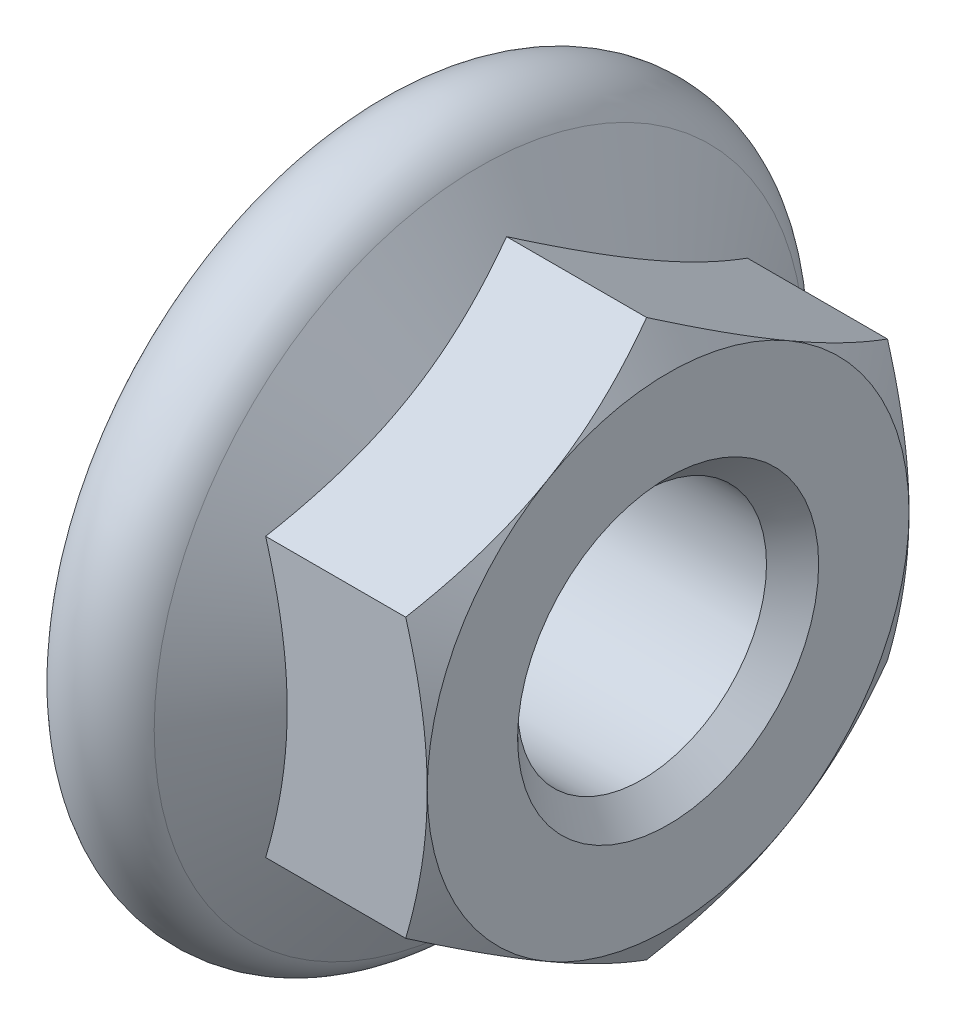
ISO-10303-21;
HEADER;
FILE_DESCRIPTION(('STEP AP214'),'2;1');
FILE_NAME('part.step','',(''),(''),'','','');
FILE_SCHEMA(('AUTOMOTIVE_DESIGN { 1 0 10303 214 1 1 1 1 }'));
ENDSEC;
DATA;
#1=APPLICATION_CONTEXT('core data for automotive mechanical design processes');
#2=APPLICATION_PROTOCOL_DEFINITION('international standard','automotive_design',2000,#1);
#3=PRODUCT_CONTEXT('',#1,'mechanical');
#4=PRODUCT('Part','Part','',(#3));
#5=PRODUCT_RELATED_PRODUCT_CATEGORY('part','',(#4));
#6=PRODUCT_DEFINITION_FORMATION('','',#4);
#7=PRODUCT_DEFINITION_CONTEXT('part definition',#1,'design');
#8=PRODUCT_DEFINITION('design','',#6,#7);
#9=PRODUCT_DEFINITION_SHAPE('','',#8);
#10=(LENGTH_UNIT() NAMED_UNIT(*) SI_UNIT(.MILLI.,.METRE.));
#11=(NAMED_UNIT(*) PLANE_ANGLE_UNIT() SI_UNIT($,.RADIAN.));
#12=(NAMED_UNIT(*) SI_UNIT($,.STERADIAN.) SOLID_ANGLE_UNIT());
#13=UNCERTAINTY_MEASURE_WITH_UNIT(LENGTH_MEASURE(1.E-05),#10,'distance_accuracy_value','');
#14=(GEOMETRIC_REPRESENTATION_CONTEXT(3) GLOBAL_UNCERTAINTY_ASSIGNED_CONTEXT((#13)) GLOBAL_UNIT_ASSIGNED_CONTEXT((#10,
#11,#12)) REPRESENTATION_CONTEXT('',''));
#15=CARTESIAN_POINT('',(0.,0.,0.));
#16=DIRECTION('',(0.,0.,1.));
#17=DIRECTION('',(1.,0.,0.));
#18=AXIS2_PLACEMENT_3D('',#15,#16,#17);
#19=CARTESIAN_POINT('',(2.67431578064992,0.,0.));
#20=DIRECTION('',(-1.,0.,0.));
#21=DIRECTION('',(0.,0.,1.));
#22=AXIS2_PLACEMENT_3D('',#19,#20,#21);
#23=CONICAL_SURFACE('',#22,4.,1.0471975511966);
#24=CARTESIAN_POINT('',(1.86602540378444,0.,0.));
#25=DIRECTION('',(-1.,0.,0.));
#26=DIRECTION('',(0.,0.,1.));
#27=AXIS2_PLACEMENT_3D('',#24,#25,#26);
#28=CIRCLE('',#27,5.4);
#29=CARTESIAN_POINT('',(1.86602540378444,0.,5.4));
#30=VERTEX_POINT('',#29);
#31=EDGE_CURVE('E242',#30,#30,#28,.T.);
#32=ORIENTED_EDGE('',*,*,#31,.F.);
#33=EDGE_LOOP('',(#32));
#34=FACE_BOUND('',#33,.T.);
#35=CARTESIAN_POINT('',(2.31705019074175,-2.3094010767585,-4.));
#36=CARTESIAN_POINT('',(2.37178264259741,-2.11982214780258,-4.));
#37=CARTESIAN_POINT('',(2.42189174829399,-1.92874348169977,-4.));
#38=CARTESIAN_POINT('',(2.51045337647502,-1.54348220920257,-4.));
#39=CARTESIAN_POINT('',(2.54887981806681,-1.34929366206929,-4.));
#40=CARTESIAN_POINT('',(2.61067418712992,-0.963095536695321,-4.));
#41=CARTESIAN_POINT('',(2.63437157633848,-0.771140332076515,-4.));
#42=CARTESIAN_POINT('',(2.666183916006,-0.386122464294638,-4.));
#43=CARTESIAN_POINT('',(2.67431578064992,-0.193061232147319,-4.));
#44=CARTESIAN_POINT('',(2.67431578064992,0.193061232147319,-4.));
#45=CARTESIAN_POINT('',(2.666183916006,0.386122464294637,-4.));
#46=CARTESIAN_POINT('',(2.63437157633848,0.771140332076515,-4.));
#47=CARTESIAN_POINT('',(2.61067418712992,0.963095536695321,-4.));
#48=CARTESIAN_POINT('',(2.54887981806681,1.34929366206929,-4.));
#49=CARTESIAN_POINT('',(2.51045337647502,1.54348220920257,-4.));
#50=CARTESIAN_POINT('',(2.42189174829399,1.92874348169977,-4.));
#51=CARTESIAN_POINT('',(2.37178264259741,2.11982214780258,-4.));
#52=CARTESIAN_POINT('',(2.31705019074175,2.3094010767585,-4.));
#53=B_SPLINE_CURVE_WITH_KNOTS('',3,(#35,#36,#37,#38,#39,#40,#41,#42,#43,#44,#45,#46,#47,#48,#49,
#50,#51,#52),.UNSPECIFIED.,.F.,.F.,(4,2,2,2,2,2,2,2,4),(0.,0.592146791772327,1.18560597204259,
1.76526171820572,2.34428722651546,2.9233127348252,3.50296848098833,4.09642766125859,
4.68857445303092),.UNSPECIFIED.);
#54=CARTESIAN_POINT('',(2.31705019074175,-2.3094010767585,-4.));
#55=VERTEX_POINT('',#54);
#56=CARTESIAN_POINT('',(2.31705019074175,2.3094010767585,-4.));
#57=VERTEX_POINT('',#56);
#58=EDGE_CURVE('E85',#55,#57,#53,.T.);
#59=ORIENTED_EDGE('',*,*,#58,.F.);
#60=CARTESIAN_POINT('',(2.31705019074175,-4.61880215351701,0.));
#61=CARTESIAN_POINT('',(2.37178264259741,-4.52401268903904,-0.16418016849807));
#62=CARTESIAN_POINT('',(2.42189174829399,-4.42847335598764,-0.329659147464344));
#63=CARTESIAN_POINT('',(2.51045337647503,-4.23584271973904,-0.663305196541237));
#64=CARTESIAN_POINT('',(2.54887981806681,-4.1387484461724,-0.831477411482652));
#65=CARTESIAN_POINT('',(2.61067418712992,-3.94564938348541,-1.16593479895044));
#66=CARTESIAN_POINT('',(2.63437157633848,-3.84967178117601,-1.33217288253896));
#67=CARTESIAN_POINT('',(2.66618391600601,-3.65716284728507,-1.66560813694899));
#68=CARTESIAN_POINT('',(2.67431578064992,-3.56063223121141,-1.83280406847449));
#69=CARTESIAN_POINT('',(2.67431578064992,-3.36757099906409,-2.1671959315255));
#70=CARTESIAN_POINT('',(2.66618391600601,-3.27104038299044,-2.334391863051));
#71=CARTESIAN_POINT('',(2.63437157633848,-3.0785314490995,-2.66782711746102));
#72=CARTESIAN_POINT('',(2.61067418712992,-2.98255384679009,-2.83406520104955));
#73=CARTESIAN_POINT('',(2.54887981806681,-2.78945478410311,-3.16852258851734));
#74=CARTESIAN_POINT('',(2.51045337647503,-2.69236051053647,-3.33669480345875));
#75=CARTESIAN_POINT('',(2.42189174829399,-2.49972987428787,-3.67034085253565));
#76=CARTESIAN_POINT('',(2.37178264259741,-2.40419054123646,-3.83581983150192));
#77=CARTESIAN_POINT('',(2.31705019074176,-2.3094010767585,-4.));
#78=B_SPLINE_CURVE_WITH_KNOTS('',3,(#60,#61,#62,#63,#64,#65,#66,#67,#68,#69,#70,#71,#72,#73,#74,
#75,#76,#77),.UNSPECIFIED.,.F.,.F.,(4,2,2,2,2,2,2,2,4),(0.,0.592146791772328,1.1856059720426,
1.76526171820573,2.34428722651546,2.9233127348252,3.50296848098833,4.0964276612586,
4.68857445303093),.UNSPECIFIED.);
#79=CARTESIAN_POINT('',(2.31705019074175,-4.61880215351701,0.));
#80=VERTEX_POINT('',#79);
#81=EDGE_CURVE('E88',#80,#55,#78,.T.);
#82=ORIENTED_EDGE('',*,*,#81,.F.);
#83=CARTESIAN_POINT('',(2.31705019074175,-2.3094010767585,4.00000000000001));
#84=CARTESIAN_POINT('',(2.37178264259741,-2.40419054123646,3.83581983150193));
#85=CARTESIAN_POINT('',(2.42189174829399,-2.49972987428787,3.67034085253566));
#86=CARTESIAN_POINT('',(2.51045337647502,-2.69236051053647,3.33669480345876));
#87=CARTESIAN_POINT('',(2.5488798180668,-2.78945478410311,3.16852258851735));
#88=CARTESIAN_POINT('',(2.61067418712992,-2.98255384679009,2.83406520104957));
#89=CARTESIAN_POINT('',(2.63437157633847,-3.0785314490995,2.66782711746104));
#90=CARTESIAN_POINT('',(2.666183916006,-3.27104038299043,2.33439186305102));
#91=CARTESIAN_POINT('',(2.67431578064992,-3.36757099906409,2.16719593152552));
#92=CARTESIAN_POINT('',(2.67431578064992,-3.56063223121141,1.83280406847451));
#93=CARTESIAN_POINT('',(2.666183916006,-3.65716284728507,1.66560813694901));
#94=CARTESIAN_POINT('',(2.63437157633847,-3.84967178117601,1.33217288253898));
#95=CARTESIAN_POINT('',(2.61067418712992,-3.94564938348542,1.16593479895045));
#96=CARTESIAN_POINT('',(2.54887981806681,-4.1387484461724,0.831477411482671));
#97=CARTESIAN_POINT('',(2.51045337647502,-4.23584271973905,0.663305196541255));
#98=CARTESIAN_POINT('',(2.42189174829399,-4.42847335598765,0.329659147464362));
#99=CARTESIAN_POINT('',(2.37178264259741,-4.52401268903905,0.164180168498087));
#100=CARTESIAN_POINT('',(2.31705019074175,-4.61880215351701,0.));
#101=B_SPLINE_CURVE_WITH_KNOTS('',3,(#83,#84,#85,#86,#87,#88,#89,#90,#91,#92,#93,#94,#95,#96,
#97,#98,#99,#100),.UNSPECIFIED.,.F.,.F.,(4,2,2,2,2,2,2,2,4),(0.,0.592146791772328,
1.18560597204259,1.76526171820572,2.34428722651546,2.9233127348252,3.50296848098833,
4.0964276612586,4.68857445303093),.UNSPECIFIED.);
#102=CARTESIAN_POINT('',(2.31705019074175,-2.3094010767585,4.00000000000001));
#103=VERTEX_POINT('',#102);
#104=EDGE_CURVE('E90',#103,#80,#101,.T.);
#105=ORIENTED_EDGE('',*,*,#104,.F.);
#106=CARTESIAN_POINT('',(2.31705019074175,2.30940107675851,4.));
#107=CARTESIAN_POINT('',(2.37178264259741,2.11982214780258,4.));
#108=CARTESIAN_POINT('',(2.42189174829399,1.92874348169978,4.));
#109=CARTESIAN_POINT('',(2.51045337647502,1.54348220920258,4.));
#110=CARTESIAN_POINT('',(2.54887981806681,1.34929366206929,4.));
#111=CARTESIAN_POINT('',(2.61067418712992,0.963095536695326,4.));
#112=CARTESIAN_POINT('',(2.63437157633847,0.77114033207652,4.));
#113=CARTESIAN_POINT('',(2.666183916006,0.386122464294641,4.));
#114=CARTESIAN_POINT('',(2.67431578064992,0.193061232147322,4.));
#115=CARTESIAN_POINT('',(2.67431578064992,-0.193061232147316,4.00000000000001));
#116=CARTESIAN_POINT('',(2.666183916006,-0.386122464294634,4.00000000000001));
#117=CARTESIAN_POINT('',(2.63437157633847,-0.771140332076512,4.00000000000001));
#118=CARTESIAN_POINT('',(2.61067418712992,-0.963095536695318,4.00000000000001));
#119=CARTESIAN_POINT('',(2.54887981806681,-1.34929366206929,4.00000000000001));
#120=CARTESIAN_POINT('',(2.51045337647502,-1.54348220920257,4.00000000000001));
#121=CARTESIAN_POINT('',(2.42189174829399,-1.92874348169977,4.00000000000001));
#122=CARTESIAN_POINT('',(2.37178264259741,-2.11982214780257,4.00000000000001));
#123=CARTESIAN_POINT('',(2.31705019074175,-2.3094010767585,4.00000000000001));
#124=B_SPLINE_CURVE_WITH_KNOTS('',3,(#106,#107,#108,#109,#110,#111,#112,#113,#114,#115,#116,
#117,#118,#119,#120,#121,#122,#123),.UNSPECIFIED.,.F.,.F.,(4,2,2,2,2,2,2,2,4),(0.,
0.592146791772328,1.1856059720426,1.76526171820573,2.34428722651547,2.9233127348252,
3.50296848098833,4.0964276612586,4.68857445303093),.UNSPECIFIED.);
#125=CARTESIAN_POINT('',(2.31705019074175,2.30940107675851,4.));
#126=VERTEX_POINT('',#125);
#127=EDGE_CURVE('E111',#126,#103,#124,.T.);
#128=ORIENTED_EDGE('',*,*,#127,.F.);
#129=CARTESIAN_POINT('',(2.31705019074175,4.61880215351701,0.));
#130=CARTESIAN_POINT('',(2.37178264259741,4.52401268903905,0.164180168498079));
#131=CARTESIAN_POINT('',(2.42189174829399,4.42847335598764,0.329659147464353));
#132=CARTESIAN_POINT('',(2.51045337647502,4.23584271973905,0.663305196541245));
#133=CARTESIAN_POINT('',(2.54887981806681,4.1387484461724,0.831477411482661));
#134=CARTESIAN_POINT('',(2.61067418712992,3.94564938348542,1.16593479895044));
#135=CARTESIAN_POINT('',(2.63437157633847,3.84967178117602,1.33217288253897));
#136=CARTESIAN_POINT('',(2.666183916006,3.65716284728508,1.66560813694899));
#137=CARTESIAN_POINT('',(2.67431578064992,3.56063223121142,1.8328040684745));
#138=CARTESIAN_POINT('',(2.67431578064992,3.3675709990641,2.1671959315255));
#139=CARTESIAN_POINT('',(2.666183916006,3.27104038299044,2.334391863051));
#140=CARTESIAN_POINT('',(2.63437157633847,3.0785314490995,2.66782711746103));
#141=CARTESIAN_POINT('',(2.61067418712992,2.9825538467901,2.83406520104955));
#142=CARTESIAN_POINT('',(2.54887981806681,2.78945478410312,3.16852258851734));
#143=CARTESIAN_POINT('',(2.51045337647502,2.69236051053648,3.33669480345875));
#144=CARTESIAN_POINT('',(2.42189174829399,2.49972987428788,3.67034085253565));
#145=CARTESIAN_POINT('',(2.37178264259741,2.40419054123647,3.83581983150192));
#146=CARTESIAN_POINT('',(2.31705019074175,2.30940107675851,4.));
#147=B_SPLINE_CURVE_WITH_KNOTS('',3,(#129,#130,#131,#132,#133,#134,#135,#136,#137,#138,#139,
#140,#141,#142,#143,#144,#145,#146),.UNSPECIFIED.,.F.,.F.,(4,2,2,2,2,2,2,2,4),(0.,
0.592146791772327,1.18560597204259,1.76526171820572,2.34428722651546,2.9233127348252,
3.50296848098832,4.09642766125859,4.68857445303092),.UNSPECIFIED.);
#148=CARTESIAN_POINT('',(2.31705019074175,4.61880215351701,0.));
#149=VERTEX_POINT('',#148);
#150=EDGE_CURVE('E115',#149,#126,#147,.T.);
#151=ORIENTED_EDGE('',*,*,#150,.F.);
#152=CARTESIAN_POINT('',(2.31705019074176,2.3094010767585,-4.));
#153=CARTESIAN_POINT('',(2.37178264259741,2.40419054123646,-3.83581983150192));
#154=CARTESIAN_POINT('',(2.42189174829399,2.49972987428787,-3.67034085253565));
#155=CARTESIAN_POINT('',(2.51045337647503,2.69236051053647,-3.33669480345876));
#156=CARTESIAN_POINT('',(2.54887981806681,2.78945478410311,-3.16852258851734));
#157=CARTESIAN_POINT('',(2.61067418712992,2.98255384679009,-2.83406520104956));
#158=CARTESIAN_POINT('',(2.63437157633848,3.0785314490995,-2.66782711746103));
#159=CARTESIAN_POINT('',(2.666183916006,3.27104038299043,-2.33439186305101));
#160=CARTESIAN_POINT('',(2.67431578064992,3.36757099906409,-2.1671959315255));
#161=CARTESIAN_POINT('',(2.67431578064992,3.56063223121141,-1.8328040684745));
#162=CARTESIAN_POINT('',(2.666183916006,3.65716284728507,-1.665608136949));
#163=CARTESIAN_POINT('',(2.63437157633848,3.84967178117601,-1.33217288253897));
#164=CARTESIAN_POINT('',(2.61067418712992,3.94564938348542,-1.16593479895044));
#165=CARTESIAN_POINT('',(2.54887981806681,4.1387484461724,-0.831477411482661));
#166=CARTESIAN_POINT('',(2.51045337647502,4.23584271973904,-0.663305196541245));
#167=CARTESIAN_POINT('',(2.42189174829399,4.42847335598764,-0.329659147464352));
#168=CARTESIAN_POINT('',(2.37178264259741,4.52401268903905,-0.164180168498078));
#169=CARTESIAN_POINT('',(2.31705019074175,4.61880215351701,0.));
#170=B_SPLINE_CURVE_WITH_KNOTS('',3,(#152,#153,#154,#155,#156,#157,#158,#159,#160,#161,#162,
#163,#164,#165,#166,#167,#168,#169),.UNSPECIFIED.,.F.,.F.,(4,2,2,2,2,2,2,2,4),(0.,
0.592146791772328,1.18560597204259,1.76526171820572,2.34428722651546,2.9233127348252,
3.50296848098833,4.0964276612586,4.68857445303093),.UNSPECIFIED.);
#171=EDGE_CURVE('E119',#57,#149,#170,.T.);
#172=ORIENTED_EDGE('',*,*,#171,.F.);
#173=EDGE_LOOP('',(#59,#82,#105,#128,#151,#172));
#174=FACE_BOUND('',#173,.T.);
#175=ADVANCED_FACE('F16',(#34,#174),#23,.T.);
#176=CARTESIAN_POINT('',(1.,0.,0.));
#177=DIRECTION('',(1.,0.,0.));
#178=DIRECTION('',(0.,0.,-1.));
#179=AXIS2_PLACEMENT_3D('',#176,#177,#178);
#180=TOROIDAL_SURFACE('',#179,4.9,0.999999999999998);
#181=CARTESIAN_POINT('',(0.,0.,0.));
#182=DIRECTION('',(1.,0.,0.));
#183=DIRECTION('',(0.,0.,-1.));
#184=AXIS2_PLACEMENT_3D('',#181,#182,#183);
#185=CIRCLE('',#184,4.9);
#186=CARTESIAN_POINT('',(0.,0.,-4.9));
#187=VERTEX_POINT('',#186);
#188=EDGE_CURVE('E341',#187,#187,#185,.F.);
#189=ORIENTED_EDGE('',*,*,#188,.F.);
#190=EDGE_LOOP('',(#189));
#191=FACE_BOUND('',#190,.T.);
#192=ORIENTED_EDGE('',*,*,#31,.T.);
#193=EDGE_LOOP('',(#192));
#194=FACE_BOUND('',#193,.T.);
#195=ADVANCED_FACE('F230',(#191,#194),#180,.T.);
#196=CARTESIAN_POINT('',(5.,-2.30940107675851,-4.));
#197=DIRECTION('',(0.,0.,-1.));
#198=DIRECTION('',(-1.,0.,0.));
#199=AXIS2_PLACEMENT_3D('',#196,#197,#198);
#200=PLANE('',#199);
#201=ORIENTED_EDGE('',*,*,#58,.T.);
#202=DIRECTION('',(-1.,0.,0.));
#203=VECTOR('',#202,1.);
#204=CARTESIAN_POINT('',(3.65852509537087,2.3094010767585,-4.));
#205=LINE('',#204,#203);
#206=CARTESIAN_POINT('',(4.64273441009184,2.3094010767585,-4.));
#207=VERTEX_POINT('',#206);
#208=EDGE_CURVE('E120',#207,#57,#205,.T.);
#209=ORIENTED_EDGE('',*,*,#208,.F.);
#210=CARTESIAN_POINT('',(5.,0.,-4.));
#211=CARTESIAN_POINT('',(5.00001634785095,0.0980211201675216,-4.));
#212=CARTESIAN_POINT('',(4.99792016762494,0.196037518325344,-4.));
#213=CARTESIAN_POINT('',(4.98962425659384,0.391877858051798,-4.));
#214=CARTESIAN_POINT('',(4.98342533816219,0.489701833876273,-4.));
#215=CARTESIAN_POINT('',(4.96708627588929,0.684525463686868,-4.));
#216=CARTESIAN_POINT('',(4.95696597305815,0.781526794452757,-4.));
#217=CARTESIAN_POINT('',(4.93300183357216,0.975067308088524,-4.));
#218=CARTESIAN_POINT('',(4.9191578989085,1.07160647872591,-4.));
#219=CARTESIAN_POINT('',(4.87246832274432,1.36013058756298,-4.));
#220=CARTESIAN_POINT('',(4.83444223792409,1.55127735241572,-4.));
#221=CARTESIAN_POINT('',(4.74674436024839,1.93192710388173,-4.));
#222=CARTESIAN_POINT('',(4.69701440671565,2.12141681308841,-4.));
#223=CARTESIAN_POINT('',(4.64273441009184,2.3094010767585,-4.));
#224=B_SPLINE_CURVE_WITH_KNOTS('',3,(#210,#211,#212,#213,#214,#215,#216,#217,#218,#219,#220,
#221,#222,#223),.UNSPECIFIED.,.F.,.F.,(4,2,2,2,2,2,4),(0.,0.2940333508003,0.588008498166854,
0.880515245106394,1.17302969179939,1.75729191101894,2.34452123773148),.UNSPECIFIED.);
#225=CARTESIAN_POINT('',(5.,0.,-4.));
#226=VERTEX_POINT('',#225);
#227=EDGE_CURVE('E211',#226,#207,#224,.T.);
#228=ORIENTED_EDGE('',*,*,#227,.F.);
#229=CARTESIAN_POINT('',(4.64273441009184,-2.3094010767585,-4.));
#230=CARTESIAN_POINT('',(4.69701440671565,-2.12141681308841,-4.));
#231=CARTESIAN_POINT('',(4.74674436024839,-1.93192710388173,-4.));
#232=CARTESIAN_POINT('',(4.83444223792409,-1.55127735241572,-4.));
#233=CARTESIAN_POINT('',(4.87246832274432,-1.36013058756298,-4.));
#234=CARTESIAN_POINT('',(4.9191578989085,-1.07160647872591,-4.));
#235=CARTESIAN_POINT('',(4.93300183357216,-0.975067308088524,-4.));
#236=CARTESIAN_POINT('',(4.95696597305815,-0.781526794452757,-4.));
#237=CARTESIAN_POINT('',(4.96708627588929,-0.684525463686869,-4.));
#238=CARTESIAN_POINT('',(4.98342533816219,-0.489701833876273,-4.));
#239=CARTESIAN_POINT('',(4.98962425659384,-0.391877858051799,-4.));
#240=CARTESIAN_POINT('',(4.99792016762494,-0.196037518325345,-4.));
#241=CARTESIAN_POINT('',(5.00001634785095,-0.0980211201675221,-4.));
#242=CARTESIAN_POINT('',(5.,0.,-4.));
#243=B_SPLINE_CURVE_WITH_KNOTS('',3,(#229,#230,#231,#232,#233,#234,#235,#236,#237,#238,#239,
#240,#241,#242),.UNSPECIFIED.,.F.,.F.,(4,2,2,2,2,2,4),(0.,0.58722932671254,1.17149154593209,
1.46400599262508,1.75651273956462,2.05048788693118,2.34452123773148),.UNSPECIFIED.);
#244=CARTESIAN_POINT('',(4.64273441009184,-2.3094010767585,-4.));
#245=VERTEX_POINT('',#244);
#246=EDGE_CURVE('E183',#245,#226,#243,.T.);
#247=ORIENTED_EDGE('',*,*,#246,.F.);
#248=DIRECTION('',(1.,0.,0.));
#249=VECTOR('',#248,1.);
#250=CARTESIAN_POINT('',(3.65852509537087,-2.3094010767585,-4.));
#251=LINE('',#250,#249);
#252=EDGE_CURVE('E95',#55,#245,#251,.T.);
#253=ORIENTED_EDGE('',*,*,#252,.F.);
#254=EDGE_LOOP('',(#201,#209,#228,#247,#253));
#255=FACE_BOUND('',#254,.T.);
#256=ADVANCED_FACE('F225',(#255),#200,.T.);
#257=CARTESIAN_POINT('',(5.,2.3094010767585,-4.));
#258=DIRECTION('',(0.,0.866025403784438,-0.500000000000001));
#259=DIRECTION('',(-1.,0.,0.));
#260=AXIS2_PLACEMENT_3D('',#257,#258,#259);
#261=PLANE('',#260);
#262=ORIENTED_EDGE('',*,*,#171,.T.);
#263=DIRECTION('',(-1.,0.,0.));
#264=VECTOR('',#263,1.);
#265=CARTESIAN_POINT('',(3.65852509537087,4.61880215351701,0.));
#266=LINE('',#265,#264);
#267=CARTESIAN_POINT('',(4.64273441009184,4.61880215351701,0.));
#268=VERTEX_POINT('',#267);
#269=EDGE_CURVE('E116',#268,#149,#266,.T.);
#270=ORIENTED_EDGE('',*,*,#269,.F.);
#271=CARTESIAN_POINT('',(5.,3.46410161513775,-2.));
#272=CARTESIAN_POINT('',(5.00001634785095,3.51311217522152,-1.91511121982752));
#273=CARTESIAN_POINT('',(4.99792016762495,3.56212037430043,-1.83022652903539));
#274=CARTESIAN_POINT('',(4.98962425659385,3.66004054416365,-1.66062381974651));
#275=CARTESIAN_POINT('',(4.98342533816219,3.70895253207589,-1.57590577158332));
#276=CARTESIAN_POINT('',(4.96708627588929,3.80636434698119,-1.40718355890985));
#277=CARTESIAN_POINT('',(4.95696597305815,3.85486501236413,-1.32317794226569));
#278=CARTESIAN_POINT('',(4.93300183357216,3.95163526918202,-1.15556694079563));
#279=CARTESIAN_POINT('',(4.9191578989085,3.99990485450071,-1.07196156656337));
#280=CARTESIAN_POINT('',(4.87246832274432,4.14416690891925,-0.822092358706202));
#281=CARTESIAN_POINT('',(4.83444223792409,4.23974029134562,-0.656554404492523));
#282=CARTESIAN_POINT('',(4.74674436024839,4.43006516707862,-0.326902049778728));
#283=CARTESIAN_POINT('',(4.69701440671565,4.52481002168196,-0.162799147850018));
#284=CARTESIAN_POINT('',(4.64273441009184,4.61880215351701,0.));
#285=B_SPLINE_CURVE_WITH_KNOTS('',3,(#271,#272,#273,#274,#275,#276,#277,#278,#279,#280,#281,
#282,#283,#284),.UNSPECIFIED.,.F.,.F.,(4,2,2,2,2,2,4),(0.,0.294033350800301,0.588008498166854,
0.880515245106395,1.17302969179939,1.75729191101894,2.34452123773148),.UNSPECIFIED.);
#286=CARTESIAN_POINT('',(5.,3.46410161513776,-2.));
#287=VERTEX_POINT('',#286);
#288=EDGE_CURVE('E291',#287,#268,#285,.T.);
#289=ORIENTED_EDGE('',*,*,#288,.F.);
#290=CARTESIAN_POINT('',(4.64273441009184,2.3094010767585,-4.));
#291=CARTESIAN_POINT('',(4.69701440671565,2.40339320859355,-3.83720085214998));
#292=CARTESIAN_POINT('',(4.74674436024839,2.49813806319689,-3.67309795022127));
#293=CARTESIAN_POINT('',(4.83444223792409,2.68846293892989,-3.34344559550748));
#294=CARTESIAN_POINT('',(4.87246832274432,2.78403632135626,-3.1779076412938));
#295=CARTESIAN_POINT('',(4.9191578989085,2.9282983757748,-2.92803843343663));
#296=CARTESIAN_POINT('',(4.93300183357216,2.97656796109349,-2.84443305920437));
#297=CARTESIAN_POINT('',(4.95696597305815,3.07333821791138,-2.67682205773431));
#298=CARTESIAN_POINT('',(4.96708627588929,3.12183888329432,-2.59281644109015));
#299=CARTESIAN_POINT('',(4.98342533816219,3.21925069819962,-2.42409422841668));
#300=CARTESIAN_POINT('',(4.98962425659384,3.26816268611185,-2.33937618025349));
#301=CARTESIAN_POINT('',(4.99792016762494,3.36608285597508,-2.16977347096461));
#302=CARTESIAN_POINT('',(5.00001634785094,3.41509105505399,-2.08488878017248));
#303=CARTESIAN_POINT('',(5.,3.46410161513775,-2.));
#304=B_SPLINE_CURVE_WITH_KNOTS('',3,(#290,#291,#292,#293,#294,#295,#296,#297,#298,#299,#300,
#301,#302,#303),.UNSPECIFIED.,.F.,.F.,(4,2,2,2,2,2,4),(0.,0.58722932671254,1.17149154593209,
1.46400599262508,1.75651273956462,2.05048788693118,2.34452123773148),.UNSPECIFIED.);
#305=EDGE_CURVE('E182',#207,#287,#304,.T.);
#306=ORIENTED_EDGE('',*,*,#305,.F.);
#307=ORIENTED_EDGE('',*,*,#208,.T.);
#308=EDGE_LOOP('',(#262,#270,#289,#306,#307));
#309=FACE_BOUND('',#308,.T.);
#310=ADVANCED_FACE('F229',(#309),#261,.T.);
#311=CARTESIAN_POINT('',(2.31705019074175,4.61880215351701,0.));
#312=DIRECTION('',(0.,0.866025403784439,0.5));
#313=DIRECTION('',(0.,-0.5,0.866025403784439));
#314=AXIS2_PLACEMENT_3D('',#311,#312,#313);
#315=PLANE('',#314);
#316=ORIENTED_EDGE('',*,*,#150,.T.);
#317=DIRECTION('',(-1.,0.,0.));
#318=VECTOR('',#317,1.);
#319=CARTESIAN_POINT('',(3.65852509537087,2.30940107675851,4.));
#320=LINE('',#319,#318);
#321=CARTESIAN_POINT('',(4.64273441009184,2.30940107675851,4.));
#322=VERTEX_POINT('',#321);
#323=EDGE_CURVE('E112',#322,#126,#320,.T.);
#324=ORIENTED_EDGE('',*,*,#323,.F.);
#325=CARTESIAN_POINT('',(4.99999999999999,3.46410161513776,2.));
#326=CARTESIAN_POINT('',(5.00001634785094,3.415091055054,2.08488878017248));
#327=CARTESIAN_POINT('',(4.99792016762494,3.36608285597509,2.16977347096461));
#328=CARTESIAN_POINT('',(4.98962425659384,3.26816268611186,2.33937618025349));
#329=CARTESIAN_POINT('',(4.98342533816218,3.21925069819962,2.42409422841668));
#330=CARTESIAN_POINT('',(4.96708627588928,3.12183888329433,2.59281644109015));
#331=CARTESIAN_POINT('',(4.95696597305814,3.07333821791138,2.67682205773431));
#332=CARTESIAN_POINT('',(4.93300183357215,2.9765679610935,2.84443305920437));
#333=CARTESIAN_POINT('',(4.91915789890849,2.9282983757748,2.92803843343663));
#334=CARTESIAN_POINT('',(4.87246832274431,2.78403632135627,3.1779076412938));
#335=CARTESIAN_POINT('',(4.83444223792408,2.6884629389299,3.34344559550748));
#336=CARTESIAN_POINT('',(4.74674436024838,2.4981380631969,3.67309795022127));
#337=CARTESIAN_POINT('',(4.69701440671564,2.40339320859356,3.83720085214998));
#338=CARTESIAN_POINT('',(4.64273441009184,2.30940107675851,4.));
#339=B_SPLINE_CURVE_WITH_KNOTS('',3,(#325,#326,#327,#328,#329,#330,#331,#332,#333,#334,#335,
#336,#337,#338),.UNSPECIFIED.,.F.,.F.,(4,2,2,2,2,2,4),(0.,0.2940333508003,0.588008498166853,
0.880515245106393,1.17302969179938,1.75729191101893,2.34452123773147),.UNSPECIFIED.);
#340=CARTESIAN_POINT('',(5.,3.46410161513776,2.));
#341=VERTEX_POINT('',#340);
#342=EDGE_CURVE('E283',#341,#322,#339,.T.);
#343=ORIENTED_EDGE('',*,*,#342,.F.);
#344=CARTESIAN_POINT('',(4.64273441009184,4.61880215351701,0.));
#345=CARTESIAN_POINT('',(4.69701440671565,4.52481002168196,0.16279914785002));
#346=CARTESIAN_POINT('',(4.74674436024839,4.43006516707862,0.326902049778729));
#347=CARTESIAN_POINT('',(4.83444223792409,4.23974029134562,0.656554404492524));
#348=CARTESIAN_POINT('',(4.87246832274432,4.14416690891925,0.822092358706203));
#349=CARTESIAN_POINT('',(4.9191578989085,3.99990485450072,1.07196156656337));
#350=CARTESIAN_POINT('',(4.93300183357216,3.95163526918202,1.15556694079563));
#351=CARTESIAN_POINT('',(4.95696597305815,3.85486501236414,1.32317794226569));
#352=CARTESIAN_POINT('',(4.96708627588929,3.80636434698119,1.40718355890985));
#353=CARTESIAN_POINT('',(4.98342533816219,3.7089525320759,1.57590577158332));
#354=CARTESIAN_POINT('',(4.98962425659384,3.66004054416366,1.66062381974651));
#355=CARTESIAN_POINT('',(4.99792016762494,3.56212037430043,1.83022652903539));
#356=CARTESIAN_POINT('',(5.00001634785095,3.51311217522152,1.91511121982752));
#357=CARTESIAN_POINT('',(5.,3.46410161513776,2.));
#358=B_SPLINE_CURVE_WITH_KNOTS('',3,(#344,#345,#346,#347,#348,#349,#350,#351,#352,#353,#354,
#355,#356,#357),.UNSPECIFIED.,.F.,.F.,(4,2,2,2,2,2,4),(0.,0.58722932671254,1.17149154593209,
1.46400599262508,1.75651273956462,2.05048788693118,2.34452123773148),.UNSPECIFIED.);
#359=EDGE_CURVE('E218',#268,#341,#358,.T.);
#360=ORIENTED_EDGE('',*,*,#359,.F.);
#361=ORIENTED_EDGE('',*,*,#269,.T.);
#362=EDGE_LOOP('',(#316,#324,#343,#360,#361));
#363=FACE_BOUND('',#362,.T.);
#364=ADVANCED_FACE('F274',(#363),#315,.T.);
#365=CARTESIAN_POINT('',(2.31705019074175,-2.3094010767585,4.00000000000001));
#366=DIRECTION('',(0.,0.,1.));
#367=DIRECTION('',(1.,0.,0.));
#368=AXIS2_PLACEMENT_3D('',#365,#366,#367);
#369=PLANE('',#368);
#370=DIRECTION('',(-1.,0.,0.));
#371=VECTOR('',#370,1.);
#372=CARTESIAN_POINT('',(3.65852509537087,-2.30940107675849,4.00000000000001));
#373=LINE('',#372,#371);
#374=CARTESIAN_POINT('',(4.64273441009184,-2.3094010767585,4.00000000000001));
#375=VERTEX_POINT('',#374);
#376=EDGE_CURVE('E101',#375,#103,#373,.T.);
#377=ORIENTED_EDGE('',*,*,#376,.F.);
#378=CARTESIAN_POINT('',(5.,0.,4.00000000000001));
#379=CARTESIAN_POINT('',(5.00001634785094,-0.0980211201675183,4.00000000000001));
#380=CARTESIAN_POINT('',(4.99792016762494,-0.196037518325341,4.00000000000001));
#381=CARTESIAN_POINT('',(4.98962425659384,-0.391877858051795,4.00000000000001));
#382=CARTESIAN_POINT('',(4.98342533816218,-0.489701833876268,4.00000000000001));
#383=CARTESIAN_POINT('',(4.96708627588929,-0.684525463686863,4.00000000000001));
#384=CARTESIAN_POINT('',(4.95696597305814,-0.781526794452752,4.00000000000001));
#385=CARTESIAN_POINT('',(4.93300183357216,-0.975067308088518,4.00000000000001));
#386=CARTESIAN_POINT('',(4.9191578989085,-1.07160647872591,4.00000000000001));
#387=CARTESIAN_POINT('',(4.87246832274431,-1.36013058756298,4.00000000000001));
#388=CARTESIAN_POINT('',(4.83444223792408,-1.55127735241571,4.00000000000001));
#389=CARTESIAN_POINT('',(4.74674436024839,-1.93192710388172,4.00000000000001));
#390=CARTESIAN_POINT('',(4.69701440671565,-2.1214168130884,4.00000000000001));
#391=CARTESIAN_POINT('',(4.64273441009184,-2.30940107675849,4.00000000000001));
#392=B_SPLINE_CURVE_WITH_KNOTS('',3,(#378,#379,#380,#381,#382,#383,#384,#385,#386,#387,#388,
#389,#390,#391),.UNSPECIFIED.,.F.,.F.,(4,2,2,2,2,2,4),(0.,0.294033350800299,0.588008498166852,
0.880515245106392,1.17302969179938,1.75729191101893,2.34452123773147),.UNSPECIFIED.);
#393=CARTESIAN_POINT('',(5.,0.,4.00000000000001));
#394=VERTEX_POINT('',#393);
#395=EDGE_CURVE('E316',#394,#375,#392,.T.);
#396=ORIENTED_EDGE('',*,*,#395,.F.);
#397=CARTESIAN_POINT('',(4.64273441009184,2.30940107675851,4.));
#398=CARTESIAN_POINT('',(4.69701440671564,2.12141681308841,4.));
#399=CARTESIAN_POINT('',(4.74674436024839,1.93192710388173,4.));
#400=CARTESIAN_POINT('',(4.83444223792408,1.55127735241572,4.));
#401=CARTESIAN_POINT('',(4.87246832274431,1.36013058756299,4.));
#402=CARTESIAN_POINT('',(4.9191578989085,1.07160647872592,4.));
#403=CARTESIAN_POINT('',(4.93300183357216,0.975067308088527,4.));
#404=CARTESIAN_POINT('',(4.95696597305814,0.78152679445276,4.));
#405=CARTESIAN_POINT('',(4.96708627588929,0.684525463686872,4.));
#406=CARTESIAN_POINT('',(4.98342533816218,0.489701833876276,4.));
#407=CARTESIAN_POINT('',(4.98962425659384,0.391877858051802,4.));
#408=CARTESIAN_POINT('',(4.99792016762494,0.196037518325348,4.));
#409=CARTESIAN_POINT('',(5.00001634785094,0.0980211201675251,4.00000000000001));
#410=CARTESIAN_POINT('',(5.,0.,4.00000000000001));
#411=B_SPLINE_CURVE_WITH_KNOTS('',3,(#397,#398,#399,#400,#401,#402,#403,#404,#405,#406,#407,
#408,#409,#410),.UNSPECIFIED.,.F.,.F.,(4,2,2,2,2,2,4),(0.,0.587229326712541,1.17149154593209,
1.46400599262508,1.75651273956462,2.05048788693118,2.34452123773148),.UNSPECIFIED.);
#412=EDGE_CURVE('E290',#322,#394,#411,.T.);
#413=ORIENTED_EDGE('',*,*,#412,.F.);
#414=ORIENTED_EDGE('',*,*,#323,.T.);
#415=ORIENTED_EDGE('',*,*,#127,.T.);
#416=EDGE_LOOP('',(#377,#396,#413,#414,#415));
#417=FACE_BOUND('',#416,.T.);
#418=ADVANCED_FACE('F277',(#417),#369,.T.);
#419=CARTESIAN_POINT('',(2.31705019074175,-4.61880215351701,0.));
#420=DIRECTION('',(0.,-0.866025403784438,0.500000000000002));
#421=DIRECTION('',(1.,0.,0.));
#422=AXIS2_PLACEMENT_3D('',#419,#420,#421);
#423=PLANE('',#422);
#424=DIRECTION('',(-1.,0.,0.));
#425=VECTOR('',#424,1.);
#426=CARTESIAN_POINT('',(3.65852509537087,-4.61880215351701,0.));
#427=LINE('',#426,#425);
#428=CARTESIAN_POINT('',(4.64273441009184,-4.61880215351701,0.));
#429=VERTEX_POINT('',#428);
#430=EDGE_CURVE('E96',#429,#80,#427,.T.);
#431=ORIENTED_EDGE('',*,*,#430,.F.);
#432=CARTESIAN_POINT('',(5.,-3.46410161513775,2.00000000000001));
#433=CARTESIAN_POINT('',(5.00001634785095,-3.51311217522152,1.91511121982753));
#434=CARTESIAN_POINT('',(4.99792016762494,-3.56212037430043,1.83022652903541));
#435=CARTESIAN_POINT('',(4.98962425659384,-3.66004054416365,1.66062381974652));
#436=CARTESIAN_POINT('',(4.98342533816219,-3.70895253207589,1.57590577158333));
#437=CARTESIAN_POINT('',(4.96708627588929,-3.80636434698119,1.40718355890986));
#438=CARTESIAN_POINT('',(4.95696597305815,-3.85486501236413,1.32317794226571));
#439=CARTESIAN_POINT('',(4.93300183357216,-3.95163526918202,1.15556694079564));
#440=CARTESIAN_POINT('',(4.9191578989085,-3.99990485450071,1.07196156656338));
#441=CARTESIAN_POINT('',(4.87246832274432,-4.14416690891925,0.822092358706216));
#442=CARTESIAN_POINT('',(4.83444223792408,-4.23974029134562,0.656554404492537));
#443=CARTESIAN_POINT('',(4.74674436024839,-4.43006516707862,0.326902049778741));
#444=CARTESIAN_POINT('',(4.69701440671565,-4.52481002168196,0.162799147850031));
#445=CARTESIAN_POINT('',(4.64273441009184,-4.61880215351701,0.));
#446=B_SPLINE_CURVE_WITH_KNOTS('',3,(#432,#433,#434,#435,#436,#437,#438,#439,#440,#441,#442,
#443,#444,#445),.UNSPECIFIED.,.F.,.F.,(4,2,2,2,2,2,4),(0.,0.2940333508003,0.588008498166853,
0.880515245106394,1.17302969179939,1.75729191101894,2.34452123773148),.UNSPECIFIED.);
#447=CARTESIAN_POINT('',(5.,-3.46410161513775,2.00000000000001));
#448=VERTEX_POINT('',#447);
#449=EDGE_CURVE('E35',#448,#429,#446,.T.);
#450=ORIENTED_EDGE('',*,*,#449,.F.);
#451=CARTESIAN_POINT('',(4.64273441009184,-2.3094010767585,4.00000000000001));
#452=CARTESIAN_POINT('',(4.69701440671564,-2.40339320859355,3.83720085214999));
#453=CARTESIAN_POINT('',(4.74674436024839,-2.49813806319689,3.67309795022128));
#454=CARTESIAN_POINT('',(4.83444223792408,-2.68846293892989,3.34344559550749));
#455=CARTESIAN_POINT('',(4.87246832274431,-2.78403632135626,3.17790764129381));
#456=CARTESIAN_POINT('',(4.9191578989085,-2.9282983757748,2.92803843343664));
#457=CARTESIAN_POINT('',(4.93300183357216,-2.97656796109349,2.84443305920438));
#458=CARTESIAN_POINT('',(4.95696597305814,-3.07333821791137,2.67682205773432));
#459=CARTESIAN_POINT('',(4.96708627588929,-3.12183888329432,2.59281644109016));
#460=CARTESIAN_POINT('',(4.98342533816219,-3.21925069819962,2.42409422841669));
#461=CARTESIAN_POINT('',(4.98962425659384,-3.26816268611185,2.3393761802535));
#462=CARTESIAN_POINT('',(4.99792016762494,-3.36608285597508,2.16977347096462));
#463=CARTESIAN_POINT('',(5.00001634785094,-3.41509105505399,2.08488878017249));
#464=CARTESIAN_POINT('',(5.,-3.46410161513775,2.00000000000001));
#465=B_SPLINE_CURVE_WITH_KNOTS('',3,(#451,#452,#453,#454,#455,#456,#457,#458,#459,#460,#461,
#462,#463,#464),.UNSPECIFIED.,.F.,.F.,(4,2,2,2,2,2,4),(0.,0.587229326712541,1.17149154593209,
1.46400599262508,1.75651273956462,2.05048788693118,2.34452123773148),.UNSPECIFIED.);
#466=EDGE_CURVE('E311',#375,#448,#465,.T.);
#467=ORIENTED_EDGE('',*,*,#466,.F.);
#468=ORIENTED_EDGE('',*,*,#376,.T.);
#469=ORIENTED_EDGE('',*,*,#104,.T.);
#470=EDGE_LOOP('',(#431,#450,#467,#468,#469));
#471=FACE_BOUND('',#470,.T.);
#472=ADVANCED_FACE('F99',(#471),#423,.T.);
#473=CARTESIAN_POINT('',(2.31705019074175,-4.61880215351701,0.));
#474=DIRECTION('',(0.,-0.866025403784439,-0.5));
#475=DIRECTION('',(0.,0.5,-0.866025403784439));
#476=AXIS2_PLACEMENT_3D('',#473,#474,#475);
#477=PLANE('',#476);
#478=ORIENTED_EDGE('',*,*,#252,.T.);
#479=CARTESIAN_POINT('',(5.,-3.46410161513775,-1.99999999999999));
#480=CARTESIAN_POINT('',(5.00001634785095,-3.41509105505399,-2.08488878017247));
#481=CARTESIAN_POINT('',(4.99792016762494,-3.36608285597508,-2.1697734709646));
#482=CARTESIAN_POINT('',(4.98962425659384,-3.26816268611185,-2.33937618025348));
#483=CARTESIAN_POINT('',(4.98342533816219,-3.21925069819962,-2.42409422841667));
#484=CARTESIAN_POINT('',(4.96708627588929,-3.12183888329432,-2.59281644109015));
#485=CARTESIAN_POINT('',(4.95696597305815,-3.07333821791138,-2.6768220577343));
#486=CARTESIAN_POINT('',(4.93300183357216,-2.97656796109349,-2.84443305920436));
#487=CARTESIAN_POINT('',(4.9191578989085,-2.9282983757748,-2.92803843343663));
#488=CARTESIAN_POINT('',(4.87246832274432,-2.78403632135626,-3.17790764129379));
#489=CARTESIAN_POINT('',(4.83444223792409,-2.68846293892989,-3.34344559550747));
#490=CARTESIAN_POINT('',(4.74674436024839,-2.49813806319689,-3.67309795022127));
#491=CARTESIAN_POINT('',(4.69701440671565,-2.40339320859355,-3.83720085214998));
#492=CARTESIAN_POINT('',(4.64273441009184,-2.3094010767585,-4.));
#493=B_SPLINE_CURVE_WITH_KNOTS('',3,(#479,#480,#481,#482,#483,#484,#485,#486,#487,#488,#489,
#490,#491,#492),.UNSPECIFIED.,.F.,.F.,(4,2,2,2,2,2,4),(0.,0.294033350800301,0.588008498166855,
0.880515245106397,1.17302969179939,1.75729191101894,2.34452123773148),.UNSPECIFIED.);
#494=CARTESIAN_POINT('',(5.,-3.46410161513775,-2.));
#495=VERTEX_POINT('',#494);
#496=EDGE_CURVE('E174',#495,#245,#493,.T.);
#497=ORIENTED_EDGE('',*,*,#496,.F.);
#498=CARTESIAN_POINT('',(4.64273441009184,-4.61880215351701,0.));
#499=CARTESIAN_POINT('',(4.69701440671565,-4.52481002168196,-0.162799147850003));
#500=CARTESIAN_POINT('',(4.74674436024839,-4.43006516707862,-0.326902049778714));
#501=CARTESIAN_POINT('',(4.83444223792409,-4.23974029134562,-0.656554404492511));
#502=CARTESIAN_POINT('',(4.87246832274432,-4.14416690891925,-0.822092358706191));
#503=CARTESIAN_POINT('',(4.9191578989085,-3.99990485450071,-1.07196156656336));
#504=CARTESIAN_POINT('',(4.93300183357216,-3.95163526918202,-1.15556694079562));
#505=CARTESIAN_POINT('',(4.95696597305814,-3.85486501236413,-1.32317794226568));
#506=CARTESIAN_POINT('',(4.96708627588929,-3.80636434698119,-1.40718355890984));
#507=CARTESIAN_POINT('',(4.98342533816219,-3.70895253207589,-1.57590577158331));
#508=CARTESIAN_POINT('',(4.98962425659384,-3.66004054416365,-1.6606238197465));
#509=CARTESIAN_POINT('',(4.99792016762494,-3.56212037430043,-1.83022652903539));
#510=CARTESIAN_POINT('',(5.00001634785094,-3.51311217522151,-1.91511121982751));
#511=CARTESIAN_POINT('',(5.,-3.46410161513775,-1.99999999999999));
#512=B_SPLINE_CURVE_WITH_KNOTS('',3,(#498,#499,#500,#501,#502,#503,#504,#505,#506,#507,#508,
#509,#510,#511),.UNSPECIFIED.,.F.,.F.,(4,2,2,2,2,2,4),(0.,0.587229326712542,1.1714915459321,
1.46400599262509,1.75651273956463,2.05048788693119,2.34452123773149),.UNSPECIFIED.);
#513=EDGE_CURVE('E105',#429,#495,#512,.T.);
#514=ORIENTED_EDGE('',*,*,#513,.F.);
#515=ORIENTED_EDGE('',*,*,#430,.T.);
#516=ORIENTED_EDGE('',*,*,#81,.T.);
#517=EDGE_LOOP('',(#478,#497,#514,#515,#516));
#518=FACE_BOUND('',#517,.T.);
#519=ADVANCED_FACE('F103',(#518),#477,.T.);
#520=CARTESIAN_POINT('',(0.,-4.998,-4.998));
#521=DIRECTION('',(-1.,0.,0.));
#522=DIRECTION('',(0.,0.,1.));
#523=AXIS2_PLACEMENT_3D('',#520,#521,#522);
#524=PLANE('',#523);
#525=CARTESIAN_POINT('',(0.,0.,0.));
#526=DIRECTION('',(-1.,0.,0.));
#527=DIRECTION('',(0.,0.,1.));
#528=AXIS2_PLACEMENT_3D('',#525,#526,#527);
#529=CIRCLE('',#528,2.50001270189222);
#530=CARTESIAN_POINT('',(0.,0.,2.50001270189222));
#531=VERTEX_POINT('',#530);
#532=EDGE_CURVE('E144',#531,#531,#529,.T.);
#533=ORIENTED_EDGE('',*,*,#532,.F.);
#534=EDGE_LOOP('',(#533));
#535=FACE_BOUND('',#534,.T.);
#536=ORIENTED_EDGE('',*,*,#188,.T.);
#537=EDGE_LOOP('',(#536));
#538=FACE_BOUND('',#537,.T.);
#539=ADVANCED_FACE('F167',(#535,#538),#524,.T.);
#540=CARTESIAN_POINT('',(4.64273441009184,0.,0.));
#541=DIRECTION('',(-1.,0.,0.));
#542=DIRECTION('',(0.,0.,1.));
#543=AXIS2_PLACEMENT_3D('',#540,#541,#542);
#544=CONICAL_SURFACE('',#543,4.618802153517,1.0471975511966);
#545=CARTESIAN_POINT('',(5.,0.,0.));
#546=DIRECTION('',(-1.,0.,0.));
#547=DIRECTION('',(0.,0.,1.));
#548=AXIS2_PLACEMENT_3D('',#545,#546,#547);
#549=CIRCLE('',#548,3.99999999999999);
#550=EDGE_CURVE('E141',#495,#226,#549,.F.);
#551=ORIENTED_EDGE('',*,*,#550,.F.);
#552=ORIENTED_EDGE('',*,*,#496,.T.);
#553=ORIENTED_EDGE('',*,*,#246,.T.);
#554=EDGE_LOOP('',(#551,#552,#553));
#555=FACE_BOUND('',#554,.T.);
#556=ADVANCED_FACE('F197',(#555),#544,.T.);
#557=CARTESIAN_POINT('',(4.64273441009184,0.,0.));
#558=DIRECTION('',(-1.,0.,0.));
#559=DIRECTION('',(0.,0.,1.));
#560=AXIS2_PLACEMENT_3D('',#557,#558,#559);
#561=CONICAL_SURFACE('',#560,4.618802153517,1.0471975511966);
#562=CARTESIAN_POINT('',(5.,0.,0.));
#563=DIRECTION('',(-1.,0.,0.));
#564=DIRECTION('',(0.,0.,1.));
#565=AXIS2_PLACEMENT_3D('',#562,#563,#564);
#566=CIRCLE('',#565,4.);
#567=EDGE_CURVE('E138',#226,#287,#566,.F.);
#568=ORIENTED_EDGE('',*,*,#567,.F.);
#569=ORIENTED_EDGE('',*,*,#227,.T.);
#570=ORIENTED_EDGE('',*,*,#305,.T.);
#571=EDGE_LOOP('',(#568,#569,#570));
#572=FACE_BOUND('',#571,.T.);
#573=ADVANCED_FACE('F200',(#572),#561,.T.);
#574=CARTESIAN_POINT('',(4.64273441009184,0.,0.));
#575=DIRECTION('',(-1.,0.,0.));
#576=DIRECTION('',(0.,0.,1.));
#577=AXIS2_PLACEMENT_3D('',#574,#575,#576);
#578=CONICAL_SURFACE('',#577,4.618802153517,1.0471975511966);
#579=CARTESIAN_POINT('',(5.,0.,0.));
#580=DIRECTION('',(-1.,0.,0.));
#581=DIRECTION('',(0.,0.,1.));
#582=AXIS2_PLACEMENT_3D('',#579,#580,#581);
#583=CIRCLE('',#582,4.);
#584=EDGE_CURVE('E135',#287,#341,#583,.F.);
#585=ORIENTED_EDGE('',*,*,#584,.F.);
#586=ORIENTED_EDGE('',*,*,#288,.T.);
#587=ORIENTED_EDGE('',*,*,#359,.T.);
#588=EDGE_LOOP('',(#585,#586,#587));
#589=FACE_BOUND('',#588,.T.);
#590=ADVANCED_FACE('F206',(#589),#578,.T.);
#591=CARTESIAN_POINT('',(4.64273441009184,0.,0.));
#592=DIRECTION('',(-1.,0.,0.));
#593=DIRECTION('',(0.,0.,1.));
#594=AXIS2_PLACEMENT_3D('',#591,#592,#593);
#595=CONICAL_SURFACE('',#594,4.61880215351702,1.0471975511966);
#596=ORIENTED_EDGE('',*,*,#412,.T.);
#597=CARTESIAN_POINT('',(5.,0.,0.));
#598=DIRECTION('',(-1.,0.,0.));
#599=DIRECTION('',(0.,0.,1.));
#600=AXIS2_PLACEMENT_3D('',#597,#598,#599);
#601=CIRCLE('',#600,4.00000000000002);
#602=EDGE_CURVE('E132',#341,#394,#601,.F.);
#603=ORIENTED_EDGE('',*,*,#602,.F.);
#604=ORIENTED_EDGE('',*,*,#342,.T.);
#605=EDGE_LOOP('',(#596,#603,#604));
#606=FACE_BOUND('',#605,.T.);
#607=ADVANCED_FACE('F301',(#606),#595,.T.);
#608=CARTESIAN_POINT('',(4.64273441009184,0.,0.));
#609=DIRECTION('',(-1.,0.,0.));
#610=DIRECTION('',(0.,0.,1.));
#611=AXIS2_PLACEMENT_3D('',#608,#609,#610);
#612=CONICAL_SURFACE('',#611,4.61880215351701,1.0471975511966);
#613=ORIENTED_EDGE('',*,*,#466,.T.);
#614=CARTESIAN_POINT('',(5.,0.,0.));
#615=DIRECTION('',(-1.,0.,0.));
#616=DIRECTION('',(0.,0.,1.));
#617=AXIS2_PLACEMENT_3D('',#614,#615,#616);
#618=CIRCLE('',#617,4.00000000000001);
#619=EDGE_CURVE('E129',#394,#448,#618,.F.);
#620=ORIENTED_EDGE('',*,*,#619,.F.);
#621=ORIENTED_EDGE('',*,*,#395,.T.);
#622=EDGE_LOOP('',(#613,#620,#621));
#623=FACE_BOUND('',#622,.T.);
#624=ADVANCED_FACE('F304',(#623),#612,.T.);
#625=CARTESIAN_POINT('',(4.64273441009184,0.,0.));
#626=DIRECTION('',(-1.,0.,0.));
#627=DIRECTION('',(0.,0.,1.));
#628=AXIS2_PLACEMENT_3D('',#625,#626,#627);
#629=CONICAL_SURFACE('',#628,4.618802153517,1.04719755119661);
#630=ORIENTED_EDGE('',*,*,#513,.T.);
#631=CARTESIAN_POINT('',(4.99999999999999,0.,0.));
#632=DIRECTION('',(-1.,0.,0.));
#633=DIRECTION('',(0.,0.,1.));
#634=AXIS2_PLACEMENT_3D('',#631,#632,#633);
#635=CIRCLE('',#634,3.99999999999999);
#636=EDGE_CURVE('E126',#448,#495,#635,.F.);
#637=ORIENTED_EDGE('',*,*,#636,.F.);
#638=ORIENTED_EDGE('',*,*,#449,.T.);
#639=EDGE_LOOP('',(#630,#637,#638));
#640=FACE_BOUND('',#639,.T.);
#641=ADVANCED_FACE('F160',(#640),#629,.T.);
#642=CARTESIAN_POINT('',(0.249999999999999,0.,0.));
#643=DIRECTION('',(-1.,0.,0.));
#644=DIRECTION('',(0.,0.,1.));
#645=AXIS2_PLACEMENT_3D('',#642,#643,#644);
#646=CONICAL_SURFACE('',#645,2.067,1.0471975511966);
#647=CARTESIAN_POINT('',(0.249999999999999,0.,0.));
#648=DIRECTION('',(-1.,0.,0.));
#649=DIRECTION('',(0.,0.,1.));
#650=AXIS2_PLACEMENT_3D('',#647,#648,#649);
#651=CIRCLE('',#650,2.067);
#652=CARTESIAN_POINT('',(0.249999999999999,0.,2.067));
#653=VERTEX_POINT('',#652);
#654=EDGE_CURVE('E125',#653,#653,#651,.T.);
#655=ORIENTED_EDGE('',*,*,#654,.F.);
#656=EDGE_LOOP('',(#655));
#657=FACE_BOUND('',#656,.T.);
#658=ORIENTED_EDGE('',*,*,#532,.T.);
#659=EDGE_LOOP('',(#658));
#660=FACE_BOUND('',#659,.T.);
#661=ADVANCED_FACE('F348',(#657,#660),#646,.F.);
#662=CARTESIAN_POINT('',(5.,-4.61880215351701,4.00000000000001));
#663=DIRECTION('',(1.,0.,0.));
#664=DIRECTION('',(0.,0.,-1.));
#665=AXIS2_PLACEMENT_3D('',#662,#663,#664);
#666=PLANE('',#665);
#667=CARTESIAN_POINT('',(5.,0.,0.));
#668=DIRECTION('',(1.,0.,0.));
#669=DIRECTION('',(0.,0.,-1.));
#670=AXIS2_PLACEMENT_3D('',#667,#668,#669);
#671=CIRCLE('',#670,2.50001270189222);
#672=CARTESIAN_POINT('',(5.,0.,-2.50001270189222));
#673=VERTEX_POINT('',#672);
#674=EDGE_CURVE('E26',#673,#673,#671,.T.);
#675=ORIENTED_EDGE('',*,*,#674,.F.);
#676=EDGE_LOOP('',(#675));
#677=FACE_BOUND('',#676,.T.);
#678=ORIENTED_EDGE('',*,*,#619,.T.);
#679=ORIENTED_EDGE('',*,*,#636,.T.);
#680=ORIENTED_EDGE('',*,*,#550,.T.);
#681=ORIENTED_EDGE('',*,*,#567,.T.);
#682=ORIENTED_EDGE('',*,*,#584,.T.);
#683=ORIENTED_EDGE('',*,*,#602,.T.);
#684=EDGE_LOOP('',(#678,#679,#680,#681,#682,#683));
#685=FACE_BOUND('',#684,.T.);
#686=ADVANCED_FACE('F329',(#677,#685),#666,.T.);
#687=CARTESIAN_POINT('',(4.56698729810778,0.,0.));
#688=DIRECTION('',(-1.,0.,0.));
#689=DIRECTION('',(0.,0.,1.));
#690=AXIS2_PLACEMENT_3D('',#687,#688,#689);
#691=CYLINDRICAL_SURFACE('',#690,2.067);
#692=CARTESIAN_POINT('',(4.56698729810778,0.,0.));
#693=DIRECTION('',(-1.,0.,0.));
#694=DIRECTION('',(0.,0.,1.));
#695=AXIS2_PLACEMENT_3D('',#692,#693,#694);
#696=CIRCLE('',#695,2.067);
#697=CARTESIAN_POINT('',(4.56698729810778,0.,2.067));
#698=VERTEX_POINT('',#697);
#699=EDGE_CURVE('E11',#698,#698,#696,.T.);
#700=ORIENTED_EDGE('',*,*,#699,.F.);
#701=EDGE_LOOP('',(#700));
#702=FACE_BOUND('',#701,.T.);
#703=ORIENTED_EDGE('',*,*,#654,.T.);
#704=EDGE_LOOP('',(#703));
#705=FACE_BOUND('',#704,.T.);
#706=ADVANCED_FACE('F355',(#702,#705),#691,.F.);
#707=CARTESIAN_POINT('',(4.56698729810778,0.,0.));
#708=DIRECTION('',(1.,0.,0.));
#709=DIRECTION('',(0.,0.,-1.));
#710=AXIS2_PLACEMENT_3D('',#707,#708,#709);
#711=CONICAL_SURFACE('',#710,2.067,0.785398163397447);
#712=ORIENTED_EDGE('',*,*,#699,.T.);
#713=EDGE_LOOP('',(#712));
#714=FACE_BOUND('',#713,.T.);
#715=ORIENTED_EDGE('',*,*,#674,.T.);
#716=EDGE_LOOP('',(#715));
#717=FACE_BOUND('',#716,.T.);
#718=ADVANCED_FACE('F18',(#714,#717),#711,.F.);
#719=CLOSED_SHELL('',(#175,#195,#256,#310,#364,#418,#472,#519,#539,#556,#573,#590,#607,#624,
#641,#661,#686,#706,#718));
#720=MANIFOLD_SOLID_BREP('B1',#719);
#721=ADVANCED_BREP_SHAPE_REPRESENTATION('',(#18,#720),#14);
#722=SHAPE_DEFINITION_REPRESENTATION(#9,#721);
ENDSEC;
END-ISO-10303-21;
